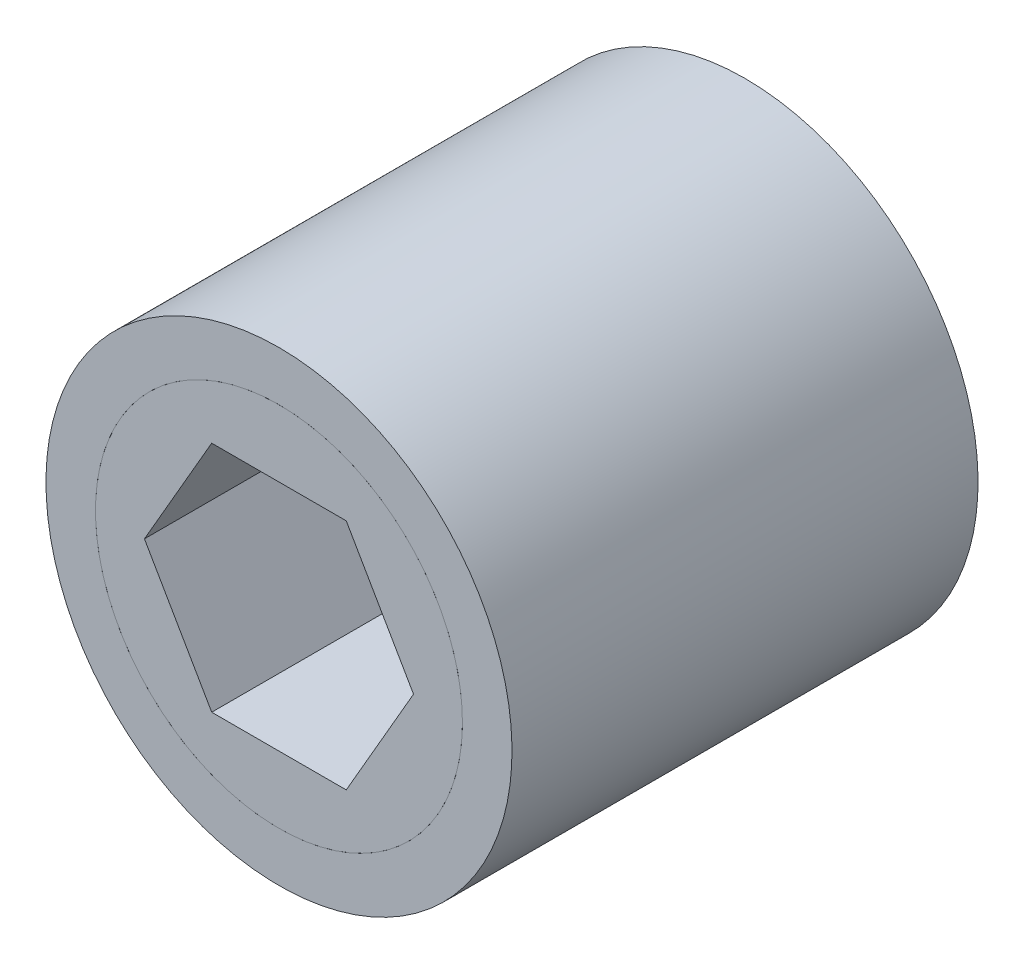
ISO-10303-21;
HEADER;
FILE_DESCRIPTION(('STEP AP214'),'2;1');
FILE_NAME('part.step','',(''),(''),'','','');
FILE_SCHEMA(('AUTOMOTIVE_DESIGN { 1 0 10303 214 1 1 1 1 }'));
ENDSEC;
DATA;
#1=APPLICATION_CONTEXT('core data for automotive mechanical design processes');
#2=APPLICATION_PROTOCOL_DEFINITION('international standard','automotive_design',2000,#1);
#3=PRODUCT_CONTEXT('',#1,'mechanical');
#4=PRODUCT('Part','Part','',(#3));
#5=PRODUCT_RELATED_PRODUCT_CATEGORY('part','',(#4));
#6=PRODUCT_DEFINITION_FORMATION('','',#4);
#7=PRODUCT_DEFINITION_CONTEXT('part definition',#1,'design');
#8=PRODUCT_DEFINITION('design','',#6,#7);
#9=PRODUCT_DEFINITION_SHAPE('','',#8);
#10=(LENGTH_UNIT() NAMED_UNIT(*) SI_UNIT(.MILLI.,.METRE.));
#11=(NAMED_UNIT(*) PLANE_ANGLE_UNIT() SI_UNIT($,.RADIAN.));
#12=(NAMED_UNIT(*) SI_UNIT($,.STERADIAN.) SOLID_ANGLE_UNIT());
#13=UNCERTAINTY_MEASURE_WITH_UNIT(LENGTH_MEASURE(1.E-05),#10,'distance_accuracy_value','');
#14=(GEOMETRIC_REPRESENTATION_CONTEXT(3) GLOBAL_UNCERTAINTY_ASSIGNED_CONTEXT((#13)) GLOBAL_UNIT_ASSIGNED_CONTEXT((#10,
#11,#12)) REPRESENTATION_CONTEXT('',''));
#15=CARTESIAN_POINT('',(0.,0.,0.));
#16=DIRECTION('',(0.,0.,1.));
#17=DIRECTION('',(1.,0.,0.));
#18=AXIS2_PLACEMENT_3D('',#15,#16,#17);
#19=CARTESIAN_POINT('',(-3.66617420935412,-6.35,25.4));
#20=DIRECTION('',(0.,1.,0.));
#21=DIRECTION('',(1.,0.,0.));
#22=AXIS2_PLACEMENT_3D('',#19,#20,#21);
#23=PLANE('',#22);
#24=DIRECTION('',(1.,0.,0.));
#25=VECTOR('',#24,1.);
#26=CARTESIAN_POINT('',(-3.66617420935412,-6.35,0.));
#27=LINE('',#26,#25);
#28=CARTESIAN_POINT('',(-3.66617420935412,-6.35,0.));
#29=VERTEX_POINT('',#28);
#30=CARTESIAN_POINT('',(3.66617420935412,-6.35,0.));
#31=VERTEX_POINT('',#30);
#32=EDGE_CURVE('P0_E179',#29,#31,#27,.T.);
#33=ORIENTED_EDGE('',*,*,#32,.F.);
#34=DIRECTION('',(0.,0.,-1.));
#35=VECTOR('',#34,1.);
#36=CARTESIAN_POINT('',(-3.66617420935412,-6.35,25.4));
#37=LINE('',#36,#35);
#38=CARTESIAN_POINT('',(-3.66617420935412,-6.35,25.4));
#39=VERTEX_POINT('',#38);
#40=EDGE_CURVE('P0_E11',#39,#29,#37,.T.);
#41=ORIENTED_EDGE('',*,*,#40,.F.);
#42=DIRECTION('',(1.,0.,0.));
#43=VECTOR('',#42,1.);
#44=CARTESIAN_POINT('',(-3.66617420935412,-6.35,25.4));
#45=LINE('',#44,#43);
#46=CARTESIAN_POINT('',(3.66617420935412,-6.35,25.4));
#47=VERTEX_POINT('',#46);
#48=EDGE_CURVE('P0_E135',#39,#47,#45,.T.);
#49=ORIENTED_EDGE('',*,*,#48,.T.);
#50=DIRECTION('',(0.,0.,-1.));
#51=VECTOR('',#50,1.);
#52=CARTESIAN_POINT('',(3.66617420935412,-6.35,25.4));
#53=LINE('',#52,#51);
#54=EDGE_CURVE('P0_E142',#47,#31,#53,.T.);
#55=ORIENTED_EDGE('',*,*,#54,.T.);
#56=EDGE_LOOP('',(#33,#41,#49,#55));
#57=FACE_BOUND('',#56,.T.);
#58=ADVANCED_FACE('P0_F17',(#57),#23,.T.);
#59=CARTESIAN_POINT('',(-7.33234841870825,0.,25.4));
#60=DIRECTION('',(0.866025403784439,0.5,0.));
#61=DIRECTION('',(0.,0.,-1.));
#62=AXIS2_PLACEMENT_3D('',#59,#60,#61);
#63=PLANE('',#62);
#64=DIRECTION('',(0.5,-0.866025403784439,0.));
#65=VECTOR('',#64,1.);
#66=CARTESIAN_POINT('',(-7.33234841870825,0.,0.));
#67=LINE('',#66,#65);
#68=CARTESIAN_POINT('',(-7.33234841870825,0.,0.));
#69=VERTEX_POINT('',#68);
#70=EDGE_CURVE('P0_E168',#69,#29,#67,.T.);
#71=ORIENTED_EDGE('',*,*,#70,.F.);
#72=DIRECTION('',(0.,0.,-1.));
#73=VECTOR('',#72,1.);
#74=CARTESIAN_POINT('',(-7.33234841870825,0.,25.4));
#75=LINE('',#74,#73);
#76=CARTESIAN_POINT('',(-7.33234841870825,0.,25.4));
#77=VERTEX_POINT('',#76);
#78=EDGE_CURVE('P0_E28',#77,#69,#75,.T.);
#79=ORIENTED_EDGE('',*,*,#78,.F.);
#80=DIRECTION('',(0.5,-0.866025403784439,0.));
#81=VECTOR('',#80,1.);
#82=CARTESIAN_POINT('',(-7.33234841870825,0.,25.4));
#83=LINE('',#82,#81);
#84=EDGE_CURVE('P0_E165',#77,#39,#83,.T.);
#85=ORIENTED_EDGE('',*,*,#84,.T.);
#86=ORIENTED_EDGE('',*,*,#40,.T.);
#87=EDGE_LOOP('',(#71,#79,#85,#86));
#88=FACE_BOUND('',#87,.T.);
#89=ADVANCED_FACE('P0_F177',(#88),#63,.T.);
#90=CARTESIAN_POINT('',(-3.66617420935412,6.35,25.4));
#91=DIRECTION('',(0.866025403784439,-0.5,0.));
#92=DIRECTION('',(0.,0.,-1.));
#93=AXIS2_PLACEMENT_3D('',#90,#91,#92);
#94=PLANE('',#93);
#95=DIRECTION('',(-0.5,-0.866025403784439,0.));
#96=VECTOR('',#95,1.);
#97=CARTESIAN_POINT('',(-3.66617420935412,6.35,0.));
#98=LINE('',#97,#96);
#99=CARTESIAN_POINT('',(-3.66617420935412,6.35,0.));
#100=VERTEX_POINT('',#99);
#101=EDGE_CURVE('P0_E152',#100,#69,#98,.T.);
#102=ORIENTED_EDGE('',*,*,#101,.F.);
#103=DIRECTION('',(0.,0.,-1.));
#104=VECTOR('',#103,1.);
#105=CARTESIAN_POINT('',(-3.66617420935412,6.35,25.4));
#106=LINE('',#105,#104);
#107=CARTESIAN_POINT('',(-3.66617420935412,6.35,25.4));
#108=VERTEX_POINT('',#107);
#109=EDGE_CURVE('P0_E111',#108,#100,#106,.T.);
#110=ORIENTED_EDGE('',*,*,#109,.F.);
#111=DIRECTION('',(-0.5,-0.866025403784439,0.));
#112=VECTOR('',#111,1.);
#113=CARTESIAN_POINT('',(-3.66617420935412,6.35,25.4));
#114=LINE('',#113,#112);
#115=EDGE_CURVE('P0_E121',#108,#77,#114,.T.);
#116=ORIENTED_EDGE('',*,*,#115,.T.);
#117=ORIENTED_EDGE('',*,*,#78,.T.);
#118=EDGE_LOOP('',(#102,#110,#116,#117));
#119=FACE_BOUND('',#118,.T.);
#120=ADVANCED_FACE('P0_F239',(#119),#94,.T.);
#121=CARTESIAN_POINT('',(3.66617420935412,6.35,25.4));
#122=DIRECTION('',(0.,-1.,0.));
#123=DIRECTION('',(0.,0.,-1.));
#124=AXIS2_PLACEMENT_3D('',#121,#122,#123);
#125=PLANE('',#124);
#126=DIRECTION('',(-1.,0.,0.));
#127=VECTOR('',#126,1.);
#128=CARTESIAN_POINT('',(3.66617420935412,6.35,0.));
#129=LINE('',#128,#127);
#130=CARTESIAN_POINT('',(3.66617420935412,6.35,0.));
#131=VERTEX_POINT('',#130);
#132=EDGE_CURVE('P0_E21',#131,#100,#129,.T.);
#133=ORIENTED_EDGE('',*,*,#132,.F.);
#134=DIRECTION('',(0.,0.,-1.));
#135=VECTOR('',#134,1.);
#136=CARTESIAN_POINT('',(3.66617420935412,6.35,25.4));
#137=LINE('',#136,#135);
#138=CARTESIAN_POINT('',(3.66617420935412,6.35,25.4));
#139=VERTEX_POINT('',#138);
#140=EDGE_CURVE('P0_E63',#139,#131,#137,.T.);
#141=ORIENTED_EDGE('',*,*,#140,.F.);
#142=DIRECTION('',(-1.,0.,0.));
#143=VECTOR('',#142,1.);
#144=CARTESIAN_POINT('',(3.66617420935412,6.35,25.4));
#145=LINE('',#144,#143);
#146=EDGE_CURVE('P0_E106',#139,#108,#145,.T.);
#147=ORIENTED_EDGE('',*,*,#146,.T.);
#148=ORIENTED_EDGE('',*,*,#109,.T.);
#149=EDGE_LOOP('',(#133,#141,#147,#148));
#150=FACE_BOUND('',#149,.T.);
#151=ADVANCED_FACE('P0_F105',(#150),#125,.T.);
#152=CARTESIAN_POINT('',(7.33234841870825,0.,25.4));
#153=DIRECTION('',(-0.866025403784439,-0.5,0.));
#154=DIRECTION('',(-0.5,0.866025403784439,0.));
#155=AXIS2_PLACEMENT_3D('',#152,#153,#154);
#156=PLANE('',#155);
#157=DIRECTION('',(-0.5,0.866025403784439,0.));
#158=VECTOR('',#157,1.);
#159=CARTESIAN_POINT('',(7.33234841870825,0.,0.));
#160=LINE('',#159,#158);
#161=CARTESIAN_POINT('',(7.33234841870825,0.,0.));
#162=VERTEX_POINT('',#161);
#163=EDGE_CURVE('P0_E144',#162,#131,#160,.T.);
#164=ORIENTED_EDGE('',*,*,#163,.F.);
#165=DIRECTION('',(0.,0.,-1.));
#166=VECTOR('',#165,1.);
#167=CARTESIAN_POINT('',(7.33234841870825,0.,25.4));
#168=LINE('',#167,#166);
#169=CARTESIAN_POINT('',(7.33234841870825,0.,25.4));
#170=VERTEX_POINT('',#169);
#171=EDGE_CURVE('P0_E76',#170,#162,#168,.T.);
#172=ORIENTED_EDGE('',*,*,#171,.F.);
#173=DIRECTION('',(-0.5,0.866025403784439,0.));
#174=VECTOR('',#173,1.);
#175=CARTESIAN_POINT('',(7.33234841870825,0.,25.4));
#176=LINE('',#175,#174);
#177=EDGE_CURVE('P0_E118',#170,#139,#176,.T.);
#178=ORIENTED_EDGE('',*,*,#177,.T.);
#179=ORIENTED_EDGE('',*,*,#140,.T.);
#180=EDGE_LOOP('',(#164,#172,#178,#179));
#181=FACE_BOUND('',#180,.T.);
#182=ADVANCED_FACE('P0_F125',(#181),#156,.T.);
#183=CARTESIAN_POINT('',(3.66617420935412,-6.35,25.4));
#184=DIRECTION('',(-0.866025403784439,0.5,0.));
#185=DIRECTION('',(0.,0.,1.));
#186=AXIS2_PLACEMENT_3D('',#183,#184,#185);
#187=PLANE('',#186);
#188=DIRECTION('',(0.5,0.866025403784439,0.));
#189=VECTOR('',#188,1.);
#190=CARTESIAN_POINT('',(3.66617420935412,-6.35,0.));
#191=LINE('',#190,#189);
#192=EDGE_CURVE('P0_E146',#31,#162,#191,.T.);
#193=ORIENTED_EDGE('',*,*,#192,.F.);
#194=ORIENTED_EDGE('',*,*,#54,.F.);
#195=DIRECTION('',(0.5,0.866025403784439,0.));
#196=VECTOR('',#195,1.);
#197=CARTESIAN_POINT('',(3.66617420935412,-6.35,25.4));
#198=LINE('',#197,#196);
#199=EDGE_CURVE('P0_E127',#47,#170,#198,.T.);
#200=ORIENTED_EDGE('',*,*,#199,.T.);
#201=ORIENTED_EDGE('',*,*,#171,.T.);
#202=EDGE_LOOP('',(#193,#194,#200,#201));
#203=FACE_BOUND('',#202,.T.);
#204=ADVANCED_FACE('P0_F19',(#203),#187,.T.);
#205=CARTESIAN_POINT('',(0.,0.,25.4));
#206=DIRECTION('',(0.,0.,-1.));
#207=DIRECTION('',(-1.,0.,0.));
#208=AXIS2_PLACEMENT_3D('',#205,#206,#207);
#209=CYLINDRICAL_SURFACE('',#208,10.);
#210=CARTESIAN_POINT('',(0.,0.,25.4));
#211=DIRECTION('',(0.,0.,1.));
#212=DIRECTION('',(1.,0.,0.));
#213=AXIS2_PLACEMENT_3D('',#210,#211,#212);
#214=CIRCLE('',#213,10.);
#215=CARTESIAN_POINT('',(10.,0.,25.4));
#216=VERTEX_POINT('',#215);
#217=EDGE_CURVE('P0_E128',#216,#216,#214,.T.);
#218=ORIENTED_EDGE('',*,*,#217,.F.);
#219=EDGE_LOOP('',(#218));
#220=FACE_BOUND('',#219,.T.);
#221=CARTESIAN_POINT('',(0.,0.,0.));
#222=DIRECTION('',(0.,0.,1.));
#223=DIRECTION('',(1.,0.,0.));
#224=AXIS2_PLACEMENT_3D('',#221,#222,#223);
#225=CIRCLE('',#224,10.);
#226=CARTESIAN_POINT('',(10.,0.,0.));
#227=VERTEX_POINT('',#226);
#228=EDGE_CURVE('P0_E123',#227,#227,#225,.T.);
#229=ORIENTED_EDGE('',*,*,#228,.T.);
#230=EDGE_LOOP('',(#229));
#231=FACE_BOUND('',#230,.T.);
#232=ADVANCED_FACE('P0_F260',(#220,#231),#209,.T.);
#233=CARTESIAN_POINT('',(0.,0.,0.));
#234=DIRECTION('',(0.,0.,1.));
#235=DIRECTION('',(1.,0.,0.));
#236=AXIS2_PLACEMENT_3D('',#233,#234,#235);
#237=PLANE('',#236);
#238=ORIENTED_EDGE('',*,*,#192,.T.);
#239=ORIENTED_EDGE('',*,*,#163,.T.);
#240=ORIENTED_EDGE('',*,*,#132,.T.);
#241=ORIENTED_EDGE('',*,*,#101,.T.);
#242=ORIENTED_EDGE('',*,*,#70,.T.);
#243=ORIENTED_EDGE('',*,*,#32,.T.);
#244=EDGE_LOOP('',(#238,#239,#240,#241,#242,#243));
#245=FACE_BOUND('',#244,.T.);
#246=ORIENTED_EDGE('',*,*,#228,.F.);
#247=EDGE_LOOP('',(#246));
#248=FACE_BOUND('',#247,.T.);
#249=ADVANCED_FACE('P0_F183',(#245,#248),#237,.F.);
#250=CARTESIAN_POINT('',(0.,0.,25.4));
#251=DIRECTION('',(0.,0.,1.));
#252=DIRECTION('',(1.,0.,0.));
#253=AXIS2_PLACEMENT_3D('',#250,#251,#252);
#254=PLANE('',#253);
#255=ORIENTED_EDGE('',*,*,#177,.F.);
#256=ORIENTED_EDGE('',*,*,#199,.F.);
#257=ORIENTED_EDGE('',*,*,#48,.F.);
#258=ORIENTED_EDGE('',*,*,#84,.F.);
#259=ORIENTED_EDGE('',*,*,#115,.F.);
#260=ORIENTED_EDGE('',*,*,#146,.F.);
#261=EDGE_LOOP('',(#255,#256,#257,#258,#259,#260));
#262=FACE_BOUND('',#261,.T.);
#263=ORIENTED_EDGE('',*,*,#217,.T.);
#264=EDGE_LOOP('',(#263));
#265=FACE_BOUND('',#264,.T.);
#266=ADVANCED_FACE('P0_F115',(#262,#265),#254,.T.);
#267=CLOSED_SHELL('',(#58,#89,#120,#151,#182,#204,#232,#249,#266));
#268=MANIFOLD_SOLID_BREP('P0_B1',#267);
#269=CARTESIAN_POINT('',(0.,0.,0.));
#270=DIRECTION('',(0.,0.,1.));
#271=DIRECTION('',(0.,-1.,0.));
#272=AXIS2_PLACEMENT_3D('',#269,#270,#271);
#273=CYLINDRICAL_SURFACE('',#272,10.);
#274=CARTESIAN_POINT('',(0.,0.,0.));
#275=DIRECTION('',(0.,0.,-1.));
#276=DIRECTION('',(0.,1.,0.));
#277=AXIS2_PLACEMENT_3D('',#274,#275,#276);
#278=CIRCLE('',#277,10.);
#279=CARTESIAN_POINT('',(0.,10.,0.));
#280=VERTEX_POINT('',#279);
#281=EDGE_CURVE('P1_E56',#280,#280,#278,.T.);
#282=ORIENTED_EDGE('',*,*,#281,.T.);
#283=EDGE_LOOP('',(#282));
#284=FACE_BOUND('',#283,.T.);
#285=CARTESIAN_POINT('',(0.,0.,25.4));
#286=DIRECTION('',(0.,0.,-1.));
#287=DIRECTION('',(0.,1.,0.));
#288=AXIS2_PLACEMENT_3D('',#285,#286,#287);
#289=CIRCLE('',#288,10.);
#290=CARTESIAN_POINT('',(0.,10.,25.4));
#291=VERTEX_POINT('',#290);
#292=EDGE_CURVE('P1_E11',#291,#291,#289,.T.);
#293=ORIENTED_EDGE('',*,*,#292,.F.);
#294=EDGE_LOOP('',(#293));
#295=FACE_BOUND('',#294,.T.);
#296=ADVANCED_FACE('P1_F18',(#284,#295),#273,.F.);
#297=CARTESIAN_POINT('',(0.,0.,0.));
#298=DIRECTION('',(0.,0.,1.));
#299=DIRECTION('',(0.,-1.,0.));
#300=AXIS2_PLACEMENT_3D('',#297,#298,#299);
#301=CYLINDRICAL_SURFACE('',#300,12.7);
#302=CARTESIAN_POINT('',(0.,0.,0.));
#303=DIRECTION('',(0.,0.,-1.));
#304=DIRECTION('',(0.,1.,0.));
#305=AXIS2_PLACEMENT_3D('',#302,#303,#304);
#306=CIRCLE('',#305,12.7);
#307=CARTESIAN_POINT('',(0.,12.7,0.));
#308=VERTEX_POINT('',#307);
#309=EDGE_CURVE('P1_E49',#308,#308,#306,.T.);
#310=ORIENTED_EDGE('',*,*,#309,.F.);
#311=EDGE_LOOP('',(#310));
#312=FACE_BOUND('',#311,.T.);
#313=CARTESIAN_POINT('',(0.,0.,25.4));
#314=DIRECTION('',(0.,0.,-1.));
#315=DIRECTION('',(0.,1.,0.));
#316=AXIS2_PLACEMENT_3D('',#313,#314,#315);
#317=CIRCLE('',#316,12.7);
#318=CARTESIAN_POINT('',(0.,12.7,25.4));
#319=VERTEX_POINT('',#318);
#320=EDGE_CURVE('P1_E28',#319,#319,#317,.T.);
#321=ORIENTED_EDGE('',*,*,#320,.T.);
#322=EDGE_LOOP('',(#321));
#323=FACE_BOUND('',#322,.T.);
#324=ADVANCED_FACE('P1_F20',(#312,#323),#301,.T.);
#325=CARTESIAN_POINT('',(0.,0.,25.4));
#326=DIRECTION('',(0.,0.,-1.));
#327=DIRECTION('',(0.,-1.,0.));
#328=AXIS2_PLACEMENT_3D('',#325,#326,#327);
#329=PLANE('',#328);
#330=ORIENTED_EDGE('',*,*,#292,.T.);
#331=EDGE_LOOP('',(#330));
#332=FACE_BOUND('',#331,.T.);
#333=ORIENTED_EDGE('',*,*,#320,.F.);
#334=EDGE_LOOP('',(#333));
#335=FACE_BOUND('',#334,.T.);
#336=ADVANCED_FACE('P1_F92',(#332,#335),#329,.F.);
#337=CARTESIAN_POINT('',(0.,0.,0.));
#338=DIRECTION('',(0.,0.,-1.));
#339=DIRECTION('',(0.,-1.,0.));
#340=AXIS2_PLACEMENT_3D('',#337,#338,#339);
#341=PLANE('',#340);
#342=ORIENTED_EDGE('',*,*,#281,.F.);
#343=EDGE_LOOP('',(#342));
#344=FACE_BOUND('',#343,.T.);
#345=ORIENTED_EDGE('',*,*,#309,.T.);
#346=EDGE_LOOP('',(#345));
#347=FACE_BOUND('',#346,.T.);
#348=ADVANCED_FACE('P1_F87',(#344,#347),#341,.T.);
#349=CLOSED_SHELL('',(#296,#324,#336,#348));
#350=MANIFOLD_SOLID_BREP('P1_B1',#349);
#351=ADVANCED_BREP_SHAPE_REPRESENTATION('',(#18,#268,#350),#14);
#352=SHAPE_DEFINITION_REPRESENTATION(#9,#351);
ENDSEC;
END-ISO-10303-21;
